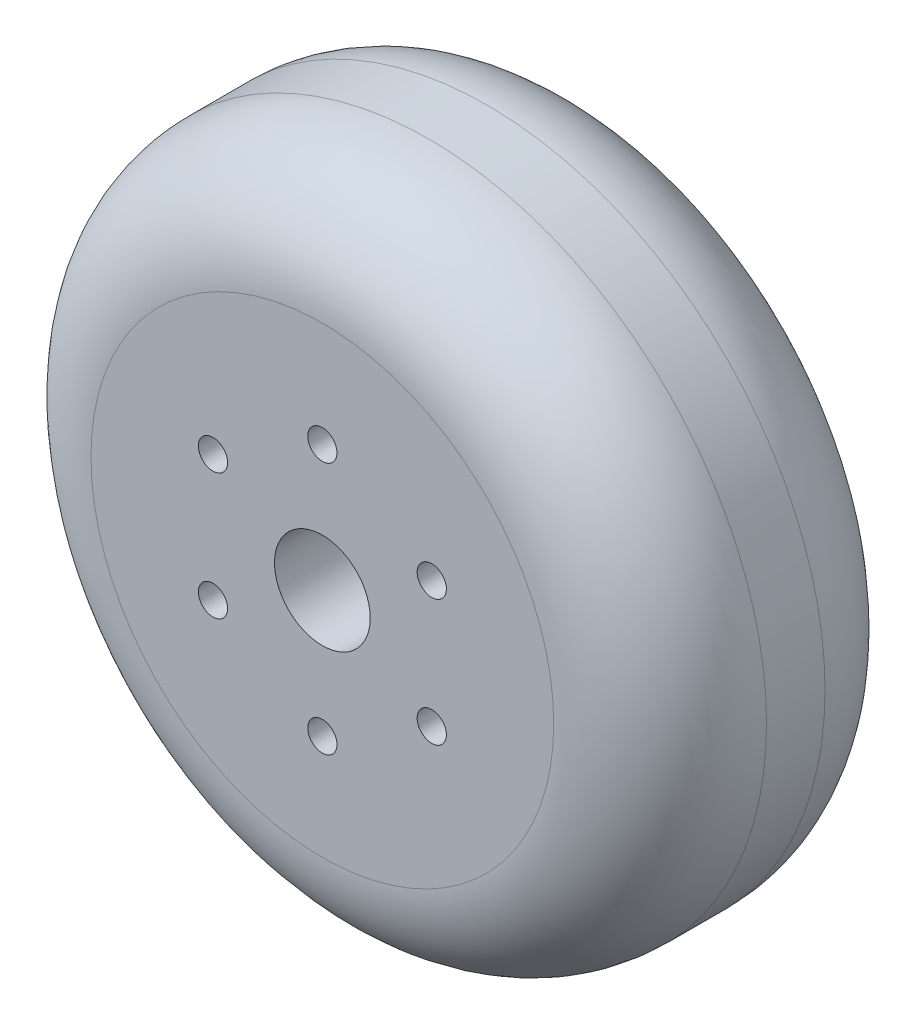
ISO-10303-21;
HEADER;
FILE_DESCRIPTION(('STEP AP214'),'2;1');
FILE_NAME('part.step','',(''),(''),'','','');
FILE_SCHEMA(('AUTOMOTIVE_DESIGN { 1 0 10303 214 1 1 1 1 }'));
ENDSEC;
DATA;
#1=APPLICATION_CONTEXT('core data for automotive mechanical design processes');
#2=APPLICATION_PROTOCOL_DEFINITION('international standard','automotive_design',2000,#1);
#3=PRODUCT_CONTEXT('',#1,'mechanical');
#4=PRODUCT('Part','Part','',(#3));
#5=PRODUCT_RELATED_PRODUCT_CATEGORY('part','',(#4));
#6=PRODUCT_DEFINITION_FORMATION('','',#4);
#7=PRODUCT_DEFINITION_CONTEXT('part definition',#1,'design');
#8=PRODUCT_DEFINITION('design','',#6,#7);
#9=PRODUCT_DEFINITION_SHAPE('','',#8);
#10=(LENGTH_UNIT() NAMED_UNIT(*) SI_UNIT(.MILLI.,.METRE.));
#11=(NAMED_UNIT(*) PLANE_ANGLE_UNIT() SI_UNIT($,.RADIAN.));
#12=(NAMED_UNIT(*) SI_UNIT($,.STERADIAN.) SOLID_ANGLE_UNIT());
#13=UNCERTAINTY_MEASURE_WITH_UNIT(LENGTH_MEASURE(1.E-05),#10,'distance_accuracy_value','');
#14=(GEOMETRIC_REPRESENTATION_CONTEXT(3) GLOBAL_UNCERTAINTY_ASSIGNED_CONTEXT((#13)) GLOBAL_UNIT_ASSIGNED_CONTEXT((#10,
#11,#12)) REPRESENTATION_CONTEXT('',''));
#15=CARTESIAN_POINT('',(0.,0.,0.));
#16=DIRECTION('',(0.,0.,1.));
#17=DIRECTION('',(1.,0.,0.));
#18=AXIS2_PLACEMENT_3D('',#15,#16,#17);
#19=CARTESIAN_POINT('',(0.,0.,51.));
#20=DIRECTION('',(0.,0.,1.));
#21=DIRECTION('',(1.,0.,0.));
#22=AXIS2_PLACEMENT_3D('',#19,#20,#21);
#23=PLANE('',#22);
#24=CARTESIAN_POINT('',(0.,23.75,51.));
#25=DIRECTION('',(0.,0.,1.));
#26=DIRECTION('',(1.,0.,0.));
#27=AXIS2_PLACEMENT_3D('',#24,#25,#26);
#28=CIRCLE('',#27,2.74999999999999);
#29=CARTESIAN_POINT('',(2.74999999999999,23.75,51.));
#30=VERTEX_POINT('',#29);
#31=EDGE_CURVE('E96',#30,#30,#28,.T.);
#32=ORIENTED_EDGE('',*,*,#31,.F.);
#33=EDGE_LOOP('',(#32));
#34=FACE_BOUND('',#33,.T.);
#35=CARTESIAN_POINT('',(20.5681033398814,11.8750000000018,51.));
#36=DIRECTION('',(0.,0.,1.));
#37=DIRECTION('',(1.,0.,0.));
#38=AXIS2_PLACEMENT_3D('',#35,#36,#37);
#39=CIRCLE('',#38,2.74999999999999);
#40=CARTESIAN_POINT('',(23.3181033398814,11.8750000000018,51.));
#41=VERTEX_POINT('',#40);
#42=EDGE_CURVE('E90',#41,#41,#39,.T.);
#43=ORIENTED_EDGE('',*,*,#42,.F.);
#44=EDGE_LOOP('',(#43));
#45=FACE_BOUND('',#44,.T.);
#46=CARTESIAN_POINT('',(20.5681033398835,-11.8749999999982,51.));
#47=DIRECTION('',(0.,0.,1.));
#48=DIRECTION('',(1.,0.,0.));
#49=AXIS2_PLACEMENT_3D('',#46,#47,#48);
#50=CIRCLE('',#49,2.74999999999999);
#51=CARTESIAN_POINT('',(23.3181033398834,-11.8749999999982,51.));
#52=VERTEX_POINT('',#51);
#53=EDGE_CURVE('E84',#52,#52,#50,.T.);
#54=ORIENTED_EDGE('',*,*,#53,.F.);
#55=EDGE_LOOP('',(#54));
#56=FACE_BOUND('',#55,.T.);
#57=CARTESIAN_POINT('',(4.04427652153662E-12,-23.75,51.));
#58=DIRECTION('',(0.,0.,1.));
#59=DIRECTION('',(1.,0.,0.));
#60=AXIS2_PLACEMENT_3D('',#57,#58,#59);
#61=CIRCLE('',#60,2.74999999999999);
#62=CARTESIAN_POINT('',(2.75000000000403,-23.75,51.));
#63=VERTEX_POINT('',#62);
#64=EDGE_CURVE('E78',#63,#63,#61,.T.);
#65=ORIENTED_EDGE('',*,*,#64,.F.);
#66=EDGE_LOOP('',(#65));
#67=FACE_BOUND('',#66,.T.);
#68=CARTESIAN_POINT('',(-20.5681033398774,-11.8750000000018,51.));
#69=DIRECTION('',(0.,0.,1.));
#70=DIRECTION('',(1.,0.,0.));
#71=AXIS2_PLACEMENT_3D('',#68,#69,#70);
#72=CIRCLE('',#71,2.74999999999999);
#73=CARTESIAN_POINT('',(-17.8181033398774,-11.8750000000018,51.));
#74=VERTEX_POINT('',#73);
#75=EDGE_CURVE('E72',#74,#74,#72,.T.);
#76=ORIENTED_EDGE('',*,*,#75,.F.);
#77=EDGE_LOOP('',(#76));
#78=FACE_BOUND('',#77,.T.);
#79=CARTESIAN_POINT('',(-20.5681033398794,11.8749999999983,51.));
#80=DIRECTION('',(0.,0.,1.));
#81=DIRECTION('',(1.,0.,0.));
#82=AXIS2_PLACEMENT_3D('',#79,#80,#81);
#83=CIRCLE('',#82,2.74999999999999);
#84=CARTESIAN_POINT('',(-17.8181033398794,11.8749999999983,51.));
#85=VERTEX_POINT('',#84);
#86=EDGE_CURVE('E66',#85,#85,#83,.T.);
#87=ORIENTED_EDGE('',*,*,#86,.F.);
#88=EDGE_LOOP('',(#87));
#89=FACE_BOUND('',#88,.T.);
#90=CARTESIAN_POINT('',(0.,0.,51.));
#91=DIRECTION('',(0.,0.,1.));
#92=DIRECTION('',(1.,0.,0.));
#93=AXIS2_PLACEMENT_3D('',#90,#91,#92);
#94=CIRCLE('',#93,43.5);
#95=CARTESIAN_POINT('',(43.5,0.,51.));
#96=VERTEX_POINT('',#95);
#97=EDGE_CURVE('E10',#96,#96,#94,.T.);
#98=ORIENTED_EDGE('',*,*,#97,.T.);
#99=EDGE_LOOP('',(#98));
#100=FACE_BOUND('',#99,.T.);
#101=CARTESIAN_POINT('',(0.,0.,51.));
#102=DIRECTION('',(0.,0.,1.));
#103=DIRECTION('',(1.,0.,0.));
#104=AXIS2_PLACEMENT_3D('',#101,#102,#103);
#105=CIRCLE('',#104,9.);
#106=CARTESIAN_POINT('',(9.,0.,51.));
#107=VERTEX_POINT('',#106);
#108=EDGE_CURVE('E57',#107,#107,#105,.T.);
#109=ORIENTED_EDGE('',*,*,#108,.F.);
#110=EDGE_LOOP('',(#109));
#111=FACE_BOUND('',#110,.T.);
#112=ADVANCED_FACE('F37',(#34,#45,#56,#67,#78,#89,#100,#111),#23,.T.);
#113=CARTESIAN_POINT('',(0.,0.,0.));
#114=DIRECTION('',(0.,0.,1.));
#115=DIRECTION('',(1.,0.,0.));
#116=AXIS2_PLACEMENT_3D('',#113,#114,#115);
#117=PLANE('',#116);
#118=CARTESIAN_POINT('',(0.,23.75,0.));
#119=DIRECTION('',(0.,0.,1.));
#120=DIRECTION('',(1.,0.,0.));
#121=AXIS2_PLACEMENT_3D('',#118,#119,#120);
#122=CIRCLE('',#121,2.74999999999999);
#123=CARTESIAN_POINT('',(2.74999999999999,23.75,0.));
#124=VERTEX_POINT('',#123);
#125=EDGE_CURVE('E93',#124,#124,#122,.T.);
#126=ORIENTED_EDGE('',*,*,#125,.T.);
#127=EDGE_LOOP('',(#126));
#128=FACE_BOUND('',#127,.T.);
#129=CARTESIAN_POINT('',(20.5681033398814,11.8750000000018,0.));
#130=DIRECTION('',(0.,0.,1.));
#131=DIRECTION('',(1.,0.,0.));
#132=AXIS2_PLACEMENT_3D('',#129,#130,#131);
#133=CIRCLE('',#132,2.74999999999999);
#134=CARTESIAN_POINT('',(23.3181033398814,11.8750000000018,0.));
#135=VERTEX_POINT('',#134);
#136=EDGE_CURVE('E87',#135,#135,#133,.T.);
#137=ORIENTED_EDGE('',*,*,#136,.T.);
#138=EDGE_LOOP('',(#137));
#139=FACE_BOUND('',#138,.T.);
#140=CARTESIAN_POINT('',(20.5681033398835,-11.8749999999982,0.));
#141=DIRECTION('',(0.,0.,1.));
#142=DIRECTION('',(1.,0.,0.));
#143=AXIS2_PLACEMENT_3D('',#140,#141,#142);
#144=CIRCLE('',#143,2.74999999999999);
#145=CARTESIAN_POINT('',(23.3181033398834,-11.8749999999982,0.));
#146=VERTEX_POINT('',#145);
#147=EDGE_CURVE('E81',#146,#146,#144,.T.);
#148=ORIENTED_EDGE('',*,*,#147,.T.);
#149=EDGE_LOOP('',(#148));
#150=FACE_BOUND('',#149,.T.);
#151=CARTESIAN_POINT('',(4.04427652153662E-12,-23.75,0.));
#152=DIRECTION('',(0.,0.,1.));
#153=DIRECTION('',(1.,0.,0.));
#154=AXIS2_PLACEMENT_3D('',#151,#152,#153);
#155=CIRCLE('',#154,2.74999999999999);
#156=CARTESIAN_POINT('',(2.75000000000404,-23.75,0.));
#157=VERTEX_POINT('',#156);
#158=EDGE_CURVE('E75',#157,#157,#155,.T.);
#159=ORIENTED_EDGE('',*,*,#158,.T.);
#160=EDGE_LOOP('',(#159));
#161=FACE_BOUND('',#160,.T.);
#162=CARTESIAN_POINT('',(-20.5681033398774,-11.8750000000018,0.));
#163=DIRECTION('',(0.,0.,1.));
#164=DIRECTION('',(1.,0.,0.));
#165=AXIS2_PLACEMENT_3D('',#162,#163,#164);
#166=CIRCLE('',#165,2.74999999999999);
#167=CARTESIAN_POINT('',(-17.8181033398774,-11.8750000000018,0.));
#168=VERTEX_POINT('',#167);
#169=EDGE_CURVE('E69',#168,#168,#166,.T.);
#170=ORIENTED_EDGE('',*,*,#169,.T.);
#171=EDGE_LOOP('',(#170));
#172=FACE_BOUND('',#171,.T.);
#173=CARTESIAN_POINT('',(-20.5681033398794,11.8749999999983,0.));
#174=DIRECTION('',(0.,0.,1.));
#175=DIRECTION('',(1.,0.,0.));
#176=AXIS2_PLACEMENT_3D('',#173,#174,#175);
#177=CIRCLE('',#176,2.74999999999999);
#178=CARTESIAN_POINT('',(-17.8181033398794,11.8749999999983,0.));
#179=VERTEX_POINT('',#178);
#180=EDGE_CURVE('E61',#179,#179,#177,.T.);
#181=ORIENTED_EDGE('',*,*,#180,.T.);
#182=EDGE_LOOP('',(#181));
#183=FACE_BOUND('',#182,.T.);
#184=CARTESIAN_POINT('',(0.,0.,0.));
#185=DIRECTION('',(0.,0.,1.));
#186=DIRECTION('',(1.,0.,0.));
#187=AXIS2_PLACEMENT_3D('',#184,#185,#186);
#188=CIRCLE('',#187,43.5);
#189=CARTESIAN_POINT('',(43.5,0.,0.));
#190=VERTEX_POINT('',#189);
#191=EDGE_CURVE('E44',#190,#190,#188,.F.);
#192=ORIENTED_EDGE('',*,*,#191,.T.);
#193=EDGE_LOOP('',(#192));
#194=FACE_BOUND('',#193,.T.);
#195=CARTESIAN_POINT('',(0.,0.,0.));
#196=DIRECTION('',(0.,0.,1.));
#197=DIRECTION('',(1.,0.,0.));
#198=AXIS2_PLACEMENT_3D('',#195,#196,#197);
#199=CIRCLE('',#198,9.);
#200=CARTESIAN_POINT('',(9.,0.,0.));
#201=VERTEX_POINT('',#200);
#202=EDGE_CURVE('E58',#201,#201,#199,.T.);
#203=ORIENTED_EDGE('',*,*,#202,.T.);
#204=EDGE_LOOP('',(#203));
#205=FACE_BOUND('',#204,.T.);
#206=ADVANCED_FACE('F104',(#128,#139,#150,#161,#172,#183,#194,#205),#117,.F.);
#207=CARTESIAN_POINT('',(0.,0.,51.));
#208=DIRECTION('',(0.,0.,-1.));
#209=DIRECTION('',(-1.,0.,0.));
#210=AXIS2_PLACEMENT_3D('',#207,#208,#209);
#211=CYLINDRICAL_SURFACE('',#210,63.5);
#212=CARTESIAN_POINT('',(0.,0.,20.));
#213=DIRECTION('',(0.,0.,1.));
#214=DIRECTION('',(1.,0.,0.));
#215=AXIS2_PLACEMENT_3D('',#212,#213,#214);
#216=CIRCLE('',#215,63.5);
#217=CARTESIAN_POINT('',(63.5,0.,20.));
#218=VERTEX_POINT('',#217);
#219=EDGE_CURVE('E48',#218,#218,#216,.T.);
#220=ORIENTED_EDGE('',*,*,#219,.T.);
#221=EDGE_LOOP('',(#220));
#222=FACE_BOUND('',#221,.T.);
#223=CARTESIAN_POINT('',(0.,0.,31.));
#224=DIRECTION('',(0.,0.,1.));
#225=DIRECTION('',(1.,0.,0.));
#226=AXIS2_PLACEMENT_3D('',#223,#224,#225);
#227=CIRCLE('',#226,63.5);
#228=CARTESIAN_POINT('',(63.5,0.,31.));
#229=VERTEX_POINT('',#228);
#230=EDGE_CURVE('E52',#229,#229,#227,.F.);
#231=ORIENTED_EDGE('',*,*,#230,.T.);
#232=EDGE_LOOP('',(#231));
#233=FACE_BOUND('',#232,.T.);
#234=ADVANCED_FACE('F122',(#222,#233),#211,.T.);
#235=CARTESIAN_POINT('',(0.,0.,51.));
#236=DIRECTION('',(0.,0.,-1.));
#237=DIRECTION('',(-1.,0.,0.));
#238=AXIS2_PLACEMENT_3D('',#235,#236,#237);
#239=CYLINDRICAL_SURFACE('',#238,9.);
#240=ORIENTED_EDGE('',*,*,#108,.T.);
#241=EDGE_LOOP('',(#240));
#242=FACE_BOUND('',#241,.T.);
#243=ORIENTED_EDGE('',*,*,#202,.F.);
#244=EDGE_LOOP('',(#243));
#245=FACE_BOUND('',#244,.T.);
#246=ADVANCED_FACE('F118',(#242,#245),#239,.F.);
#247=CARTESIAN_POINT('',(0.,0.,20.));
#248=DIRECTION('',(0.,0.,1.));
#249=DIRECTION('',(1.,0.,0.));
#250=AXIS2_PLACEMENT_3D('',#247,#248,#249);
#251=TOROIDAL_SURFACE('',#250,43.5,20.);
#252=ORIENTED_EDGE('',*,*,#191,.F.);
#253=EDGE_LOOP('',(#252));
#254=FACE_BOUND('',#253,.T.);
#255=ORIENTED_EDGE('',*,*,#219,.F.);
#256=EDGE_LOOP('',(#255));
#257=FACE_BOUND('',#256,.T.);
#258=ADVANCED_FACE('F121',(#254,#257),#251,.T.);
#259=CARTESIAN_POINT('',(0.,0.,31.));
#260=DIRECTION('',(0.,0.,1.));
#261=DIRECTION('',(1.,0.,0.));
#262=AXIS2_PLACEMENT_3D('',#259,#260,#261);
#263=TOROIDAL_SURFACE('',#262,43.5,20.);
#264=ORIENTED_EDGE('',*,*,#230,.F.);
#265=EDGE_LOOP('',(#264));
#266=FACE_BOUND('',#265,.T.);
#267=ORIENTED_EDGE('',*,*,#97,.F.);
#268=EDGE_LOOP('',(#267));
#269=FACE_BOUND('',#268,.T.);
#270=ADVANCED_FACE('F39',(#266,#269),#263,.T.);
#271=CARTESIAN_POINT('',(-20.5681033398794,11.8749999999983,51.));
#272=DIRECTION('',(0.,0.,1.));
#273=DIRECTION('',(1.,0.,0.));
#274=AXIS2_PLACEMENT_3D('',#271,#272,#273);
#275=CYLINDRICAL_SURFACE('',#274,2.74999999999999);
#276=ORIENTED_EDGE('',*,*,#180,.F.);
#277=EDGE_LOOP('',(#276));
#278=FACE_BOUND('',#277,.T.);
#279=ORIENTED_EDGE('',*,*,#86,.T.);
#280=EDGE_LOOP('',(#279));
#281=FACE_BOUND('',#280,.T.);
#282=ADVANCED_FACE('F140',(#278,#281),#275,.F.);
#283=CARTESIAN_POINT('',(-20.5681033398774,-11.8750000000018,51.));
#284=DIRECTION('',(0.,0.,1.));
#285=DIRECTION('',(1.,0.,0.));
#286=AXIS2_PLACEMENT_3D('',#283,#284,#285);
#287=CYLINDRICAL_SURFACE('',#286,2.74999999999999);
#288=ORIENTED_EDGE('',*,*,#169,.F.);
#289=EDGE_LOOP('',(#288));
#290=FACE_BOUND('',#289,.T.);
#291=ORIENTED_EDGE('',*,*,#75,.T.);
#292=EDGE_LOOP('',(#291));
#293=FACE_BOUND('',#292,.T.);
#294=ADVANCED_FACE('F150',(#290,#293),#287,.F.);
#295=CARTESIAN_POINT('',(4.04427652153662E-12,-23.75,51.));
#296=DIRECTION('',(0.,0.,1.));
#297=DIRECTION('',(1.,0.,0.));
#298=AXIS2_PLACEMENT_3D('',#295,#296,#297);
#299=CYLINDRICAL_SURFACE('',#298,2.74999999999999);
#300=ORIENTED_EDGE('',*,*,#158,.F.);
#301=EDGE_LOOP('',(#300));
#302=FACE_BOUND('',#301,.T.);
#303=ORIENTED_EDGE('',*,*,#64,.T.);
#304=EDGE_LOOP('',(#303));
#305=FACE_BOUND('',#304,.T.);
#306=ADVANCED_FACE('F156',(#302,#305),#299,.F.);
#307=CARTESIAN_POINT('',(20.5681033398835,-11.8749999999982,51.));
#308=DIRECTION('',(0.,0.,1.));
#309=DIRECTION('',(1.,0.,0.));
#310=AXIS2_PLACEMENT_3D('',#307,#308,#309);
#311=CYLINDRICAL_SURFACE('',#310,2.74999999999999);
#312=ORIENTED_EDGE('',*,*,#147,.F.);
#313=EDGE_LOOP('',(#312));
#314=FACE_BOUND('',#313,.T.);
#315=ORIENTED_EDGE('',*,*,#53,.T.);
#316=EDGE_LOOP('',(#315));
#317=FACE_BOUND('',#316,.T.);
#318=ADVANCED_FACE('F164',(#314,#317),#311,.F.);
#319=CARTESIAN_POINT('',(20.5681033398814,11.8750000000018,51.));
#320=DIRECTION('',(0.,0.,1.));
#321=DIRECTION('',(1.,0.,0.));
#322=AXIS2_PLACEMENT_3D('',#319,#320,#321);
#323=CYLINDRICAL_SURFACE('',#322,2.74999999999999);
#324=ORIENTED_EDGE('',*,*,#136,.F.);
#325=EDGE_LOOP('',(#324));
#326=FACE_BOUND('',#325,.T.);
#327=ORIENTED_EDGE('',*,*,#42,.T.);
#328=EDGE_LOOP('',(#327));
#329=FACE_BOUND('',#328,.T.);
#330=ADVANCED_FACE('F168',(#326,#329),#323,.F.);
#331=CARTESIAN_POINT('',(0.,23.75,51.));
#332=DIRECTION('',(0.,0.,1.));
#333=DIRECTION('',(1.,0.,0.));
#334=AXIS2_PLACEMENT_3D('',#331,#332,#333);
#335=CYLINDRICAL_SURFACE('',#334,2.74999999999999);
#336=ORIENTED_EDGE('',*,*,#125,.F.);
#337=EDGE_LOOP('',(#336));
#338=FACE_BOUND('',#337,.T.);
#339=ORIENTED_EDGE('',*,*,#31,.T.);
#340=EDGE_LOOP('',(#339));
#341=FACE_BOUND('',#340,.T.);
#342=ADVANCED_FACE('F100',(#338,#341),#335,.F.);
#343=CLOSED_SHELL('',(#112,#206,#234,#246,#258,#270,#282,#294,#306,#318,#330,#342));
#344=MANIFOLD_SOLID_BREP('B2',#343);
#345=ADVANCED_BREP_SHAPE_REPRESENTATION('',(#18,#344),#14);
#346=SHAPE_DEFINITION_REPRESENTATION(#9,#345);
ENDSEC;
END-ISO-10303-21;
